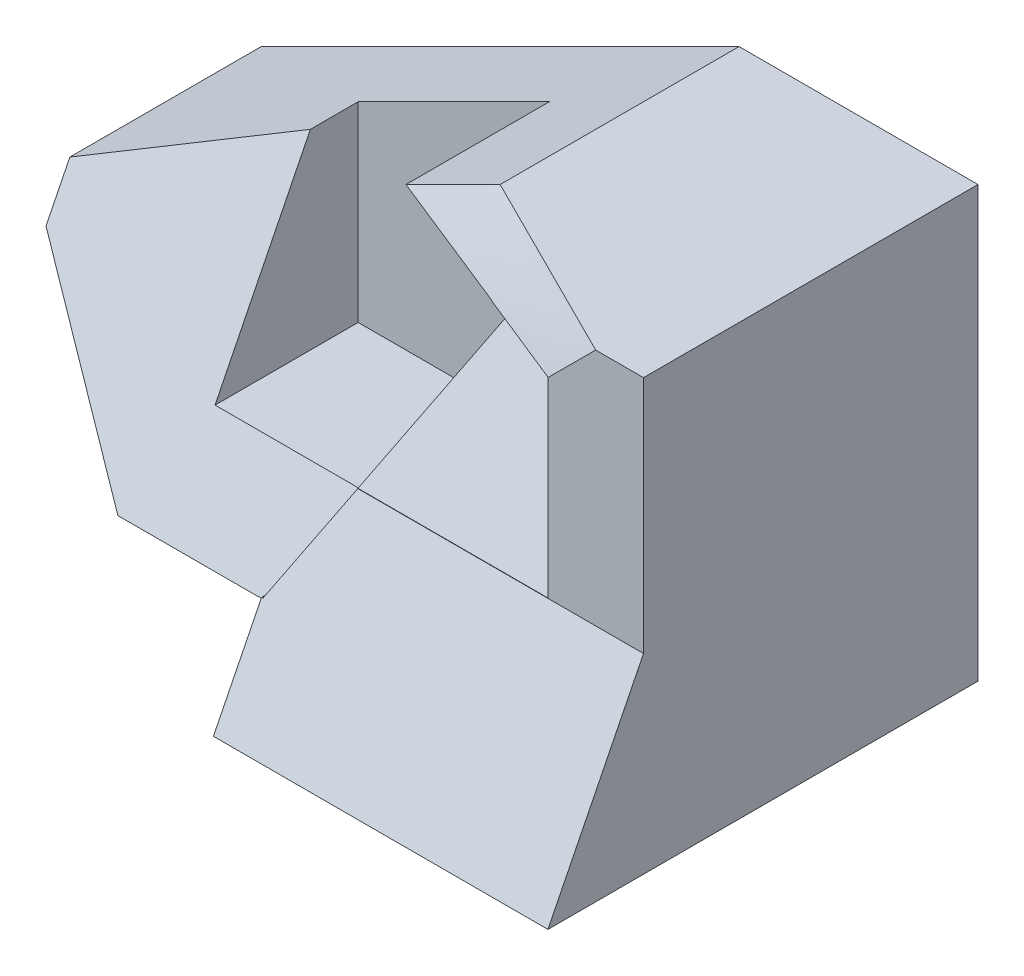
ISO-10303-21;
HEADER;
FILE_DESCRIPTION(('STEP AP214'),'2;1');
FILE_NAME('part.step','',(''),(''),'','','');
FILE_SCHEMA(('AUTOMOTIVE_DESIGN { 1 0 10303 214 1 1 1 1 }'));
ENDSEC;
DATA;
#1=APPLICATION_CONTEXT('core data for automotive mechanical design processes');
#2=APPLICATION_PROTOCOL_DEFINITION('international standard','automotive_design',2000,#1);
#3=PRODUCT_CONTEXT('',#1,'mechanical');
#4=PRODUCT('Part','Part','',(#3));
#5=PRODUCT_RELATED_PRODUCT_CATEGORY('part','',(#4));
#6=PRODUCT_DEFINITION_FORMATION('','',#4);
#7=PRODUCT_DEFINITION_CONTEXT('part definition',#1,'design');
#8=PRODUCT_DEFINITION('design','',#6,#7);
#9=PRODUCT_DEFINITION_SHAPE('','',#8);
#10=(LENGTH_UNIT() NAMED_UNIT(*) SI_UNIT(.MILLI.,.METRE.));
#11=(NAMED_UNIT(*) PLANE_ANGLE_UNIT() SI_UNIT($,.RADIAN.));
#12=(NAMED_UNIT(*) SI_UNIT($,.STERADIAN.) SOLID_ANGLE_UNIT());
#13=UNCERTAINTY_MEASURE_WITH_UNIT(LENGTH_MEASURE(1.E-05),#10,'distance_accuracy_value','');
#14=(GEOMETRIC_REPRESENTATION_CONTEXT(3) GLOBAL_UNCERTAINTY_ASSIGNED_CONTEXT((#13)) GLOBAL_UNIT_ASSIGNED_CONTEXT((#10,
#11,#12)) REPRESENTATION_CONTEXT('',''));
#15=CARTESIAN_POINT('',(0.,0.,0.));
#16=DIRECTION('',(0.,0.,1.));
#17=DIRECTION('',(1.,0.,0.));
#18=AXIS2_PLACEMENT_3D('',#15,#16,#17);
#19=CARTESIAN_POINT('',(7.5,-0.5,7.));
#20=DIRECTION('',(0.,0.,-1.));
#21=DIRECTION('',(-1.,0.,0.));
#22=AXIS2_PLACEMENT_3D('',#19,#20,#21);
#23=PLANE('',#22);
#24=DIRECTION('',(-1.,0.,0.));
#25=VECTOR('',#24,1.);
#26=CARTESIAN_POINT('',(1.5,-0.492869743501298,7.));
#27=LINE('',#26,#25);
#28=CARTESIAN_POINT('',(1.5,-0.492869743501298,7.));
#29=VERTEX_POINT('',#28);
#30=CARTESIAN_POINT('',(-2.47486662032889,-0.492869743501298,7.));
#31=VERTEX_POINT('',#30);
#32=EDGE_CURVE('E476',#29,#31,#27,.T.);
#33=ORIENTED_EDGE('',*,*,#32,.T.);
#34=DIRECTION('',(0.447213595499958,0.894427190999916,0.));
#35=VECTOR('',#34,1.);
#36=CARTESIAN_POINT('',(-0.482745398862595,3.4913726994313,7.));
#37=LINE('',#36,#35);
#38=CARTESIAN_POINT('',(-2.47843174857824,-0.5,7.));
#39=VERTEX_POINT('',#38);
#40=EDGE_CURVE('E226',#39,#31,#37,.T.);
#41=ORIENTED_EDGE('',*,*,#40,.F.);
#42=DIRECTION('',(-1.,0.,0.));
#43=VECTOR('',#42,1.);
#44=CARTESIAN_POINT('',(7.5,-0.5,7.));
#45=LINE('',#44,#43);
#46=CARTESIAN_POINT('',(3.5,-0.5,7.));
#47=VERTEX_POINT('',#46);
#48=EDGE_CURVE('E348',#47,#39,#45,.T.);
#49=ORIENTED_EDGE('',*,*,#48,.F.);
#50=DIRECTION('',(0.,-1.,0.));
#51=VECTOR('',#50,1.);
#52=CARTESIAN_POINT('',(3.5,0.,7.));
#53=LINE('',#52,#51);
#54=CARTESIAN_POINT('',(3.5,4.5,7.));
#55=VERTEX_POINT('',#54);
#56=EDGE_CURVE('E332',#55,#47,#53,.T.);
#57=ORIENTED_EDGE('',*,*,#56,.F.);
#58=DIRECTION('',(-1.,0.,0.));
#59=VECTOR('',#58,1.);
#60=CARTESIAN_POINT('',(7.5,4.5,7.));
#61=LINE('',#60,#59);
#62=CARTESIAN_POINT('',(2.49977305080841,4.5,7.));
#63=VERTEX_POINT('',#62);
#64=EDGE_CURVE('E202',#55,#63,#61,.T.);
#65=ORIENTED_EDGE('',*,*,#64,.T.);
#66=CARTESIAN_POINT('',(1.49984256727102,3.50023558025882,7.00035393969887));
#67=CARTESIAN_POINT('',(1.54154025122701,3.5418578548861,7.00028602755366));
#68=CARTESIAN_POINT('',(1.58323385365635,3.58348423070897,7.00022548460574));
#69=CARTESIAN_POINT('',(1.66661437244845,3.66674698740989,7.000119430403));
#70=CARTESIAN_POINT('',(1.70830128848242,3.70838336861796,7.00007391974148));
#71=CARTESIAN_POINT('',(1.79166827536595,3.79166630698385,6.99999822731414));
#72=CARTESIAN_POINT('',(1.83334834587801,3.83331286448009,6.99996804615703));
#73=CARTESIAN_POINT('',(1.91670218997631,3.91661540066699,6.99992183927005));
#74=CARTESIAN_POINT('',(1.95837596326924,3.95827137965143,6.99990581406888));
#75=CARTESIAN_POINT('',(2.04171776780298,4.04159198568228,6.99988672311779));
#76=CARTESIAN_POINT('',(2.08338579879336,4.08325661297931,6.99988365781909));
#77=CARTESIAN_POINT('',(2.16671612864367,4.16659454703394,6.99989050601463));
#78=CARTESIAN_POINT('',(2.20837842724855,4.20826785404655,6.99990041996821));
#79=CARTESIAN_POINT('',(2.29169636476838,4.29162470726169,6.99993546667126));
#80=CARTESIAN_POINT('',(2.33335200331941,4.33330825382781,6.99996060007591));
#81=CARTESIAN_POINT('',(2.41665290525704,4.41669087261401,7.00003419264835));
#82=CARTESIAN_POINT('',(2.45829816783691,4.45838994563868,7.00008265326727));
#83=CARTESIAN_POINT('',(2.49993468972115,4.50009772894676,7.00014682989165));
#84=B_SPLINE_CURVE_WITH_KNOTS('',3,(#66,#67,#68,#69,#70,#71,#72,#73,#74,#75,#76,#77,#78,#79,#80,
#81,#82,#83),.UNSPECIFIED.,.F.,.F.,(4,2,2,2,2,2,2,2,4),(0.,0.176748512518118,0.353504000122477,
0.530266505682153,0.707035612557251,0.883810873872694,1.06059239155166,1.23738151991769,
1.41418164734069),.UNSPECIFIED.);
#85=CARTESIAN_POINT('',(1.5,3.50063107740926,7.));
#86=VERTEX_POINT('',#85);
#87=EDGE_CURVE('E360',#63,#86,#84,.F.);
#88=ORIENTED_EDGE('',*,*,#87,.T.);
#89=DIRECTION('',(0.,-1.,0.));
#90=VECTOR('',#89,1.);
#91=CARTESIAN_POINT('',(1.5,0.,7.));
#92=LINE('',#91,#90);
#93=EDGE_CURVE('E424',#86,#29,#92,.T.);
#94=ORIENTED_EDGE('',*,*,#93,.T.);
#95=EDGE_LOOP('',(#33,#41,#49,#57,#65,#88,#94));
#96=FACE_BOUND('',#95,.T.);
#97=ADVANCED_FACE('F36',(#96),#23,.F.);
#98=CARTESIAN_POINT('',(-3.47124233143765,-2.48562116571883,21.));
#99=DIRECTION('',(-0.894427190999916,0.447213595499958,0.));
#100=DIRECTION('',(-0.447213595499958,-0.894427190999916,0.));
#101=AXIS2_PLACEMENT_3D('',#98,#99,#100);
#102=PLANE('',#101);
#103=DIRECTION('',(0.,0.,-1.));
#104=VECTOR('',#103,1.);
#105=CARTESIAN_POINT('',(-0.471242331437655,3.51437883428117,21.));
#106=LINE('',#105,#104);
#107=CARTESIAN_POINT('',(-0.471242331437655,3.51437883428117,6.20218765704122));
#108=VERTEX_POINT('',#107);
#109=CARTESIAN_POINT('',(-0.471242331437655,3.51437883428117,4.99994094462811));
#110=VERTEX_POINT('',#109);
#111=EDGE_CURVE('E183',#108,#110,#106,.T.);
#112=ORIENTED_EDGE('',*,*,#111,.T.);
#113=DIRECTION('',(-0.00216607987061889,-0.00433215974123779,0.999988270176191));
#114=VECTOR('',#113,1.);
#115=CARTESIAN_POINT('',(-0.505969709291035,3.44492407857441,21.0321154633974));
#116=LINE('',#115,#114);
#117=CARTESIAN_POINT('',(-0.473850748912953,3.50916199933143,6.20413794307477));
#118=VERTEX_POINT('',#117);
#119=EDGE_CURVE('E405',#110,#118,#116,.T.);
#120=ORIENTED_EDGE('',*,*,#119,.T.);
#121=CARTESIAN_POINT('',(-0.471242331437655,3.51437883428117,6.20218765704122));
#122=CARTESIAN_POINT('',(-0.473999030136539,3.50886543688341,6.20424452136744));
#123=CARTESIAN_POINT('',(-0.476755728835423,3.50335203948564,6.20630138569367));
#124=CARTESIAN_POINT('',(-0.479512427534307,3.49783864208787,6.2083582500199));
#125=B_SPLINE_CURVE_WITH_KNOTS('',3,(#121,#122,#123,#124),.UNSPECIFIED.,.F.,.F.,(4,4),(0.,
0.0194948368792279),.UNSPECIFIED.);
#126=EDGE_CURVE('E184',#108,#118,#125,.T.);
#127=ORIENTED_EDGE('',*,*,#126,.F.);
#128=EDGE_LOOP('',(#112,#120,#127));
#129=FACE_BOUND('',#128,.T.);
#130=ADVANCED_FACE('F453',(#129),#102,.T.);
#131=ORIENTED_EDGE('',*,*,#40,.T.);
#132=DIRECTION('',(0.408369308842792,0.816738617685584,-0.40764265966199));
#133=VECTOR('',#132,1.);
#134=CARTESIAN_POINT('',(-5.63623456727883,-6.81560563740118,10.155742633345));
#135=LINE('',#134,#133);
#136=EDGE_CURVE('E407',#31,#110,#135,.T.);
#137=ORIENTED_EDGE('',*,*,#136,.T.);
#138=CARTESIAN_POINT('',(-0.471242331437655,3.51437883428117,2.));
#139=VERTEX_POINT('',#138);
#140=EDGE_CURVE('E361',#110,#139,#106,.T.);
#141=ORIENTED_EDGE('',*,*,#140,.T.);
#142=DIRECTION('',(0.447213595499958,0.894427190999916,0.));
#143=VECTOR('',#142,1.);
#144=CARTESIAN_POINT('',(-3.47124233143765,-2.48562116571883,2.));
#145=LINE('',#144,#143);
#146=CARTESIAN_POINT('',(-3.47124233143765,-2.48562116571883,2.));
#147=VERTEX_POINT('',#146);
#148=EDGE_CURVE('E216',#147,#139,#145,.T.);
#149=ORIENTED_EDGE('',*,*,#148,.F.);
#150=DIRECTION('',(0.,0.,-1.));
#151=VECTOR('',#150,1.);
#152=CARTESIAN_POINT('',(-3.47124233143765,-2.48562116571883,21.));
#153=LINE('',#152,#151);
#154=CARTESIAN_POINT('',(-3.47124233143765,-2.48562116571883,7.99281058285941));
#155=VERTEX_POINT('',#154);
#156=EDGE_CURVE('E194',#155,#147,#153,.T.);
#157=ORIENTED_EDGE('',*,*,#156,.F.);
#158=DIRECTION('',(0.408248290463863,0.816496580927726,-0.408248290463863));
#159=VECTOR('',#158,1.);
#160=CARTESIAN_POINT('',(-2.48202645714853,-0.507189417140588,7.00359470857029));
#161=LINE('',#160,#159);
#162=EDGE_CURVE('E359',#155,#39,#161,.T.);
#163=ORIENTED_EDGE('',*,*,#162,.T.);
#164=EDGE_LOOP('',(#131,#137,#141,#149,#157,#163));
#165=FACE_BOUND('',#164,.T.);
#166=ADVANCED_FACE('F239',(#165),#102,.T.);
#167=CARTESIAN_POINT('',(-3.2134896634337,4.46783317184116,4.21721920120658));
#168=CARTESIAN_POINT('',(-3.28407811873943,4.28538441356447,4.38574103230916));
#169=CARTESIAN_POINT('',(-3.3512269981157,4.09778874520229,4.5465300444748));
#170=CARTESIAN_POINT('',(-3.414958153101,3.90507886494363,4.69963536410574));
#171=CARTESIAN_POINT('',(-3.47534520366187,3.70736493617954,4.84522250284732));
#172=CARTESIAN_POINT('',(-3.53235622426733,3.50459918620763,4.98321968605188));
#173=CARTESIAN_POINT('',(-2.04076601172285,4.48999384287458,4.73572870121885));
#174=CARTESIAN_POINT('',(-2.10791871251505,4.30240389279996,4.89652630465217));
#175=CARTESIAN_POINT('',(-2.17164424334459,4.10968559667126,5.04961898011446));
#176=CARTESIAN_POINT('',(-2.2318359484023,3.91167935694764,5.19476694512154));
#177=CARTESIAN_POINT('',(-2.28857414539643,3.70850535938198,5.33215076911223));
#178=CARTESIAN_POINT('',(-2.34190688161649,3.50023550094183,5.46187847150458));
#179=CARTESIAN_POINT('',(-0.872937499707002,4.51947949942457,5.26524340353192));
#180=CARTESIAN_POINT('',(-0.936119373834301,4.32594768668183,5.41711383563382));
#181=CARTESIAN_POINT('',(-0.995481770533379,4.12670048712986,5.56039735818878));
#182=CARTESIAN_POINT('',(-1.05099566619408,3.92169447044035,5.6950287206174));
#183=CARTESIAN_POINT('',(-1.10285577935102,3.71122100939011,5.82144568711002));
#184=CARTESIAN_POINT('',(-1.15106390058195,3.49528278336256,5.93965228322496));
#185=CARTESIAN_POINT('',(0.275747592240914,4.57761097273765,5.83779614432843));
#186=CARTESIAN_POINT('',(0.222569284786626,4.36911003029518,5.96717666157095));
#187=CARTESIAN_POINT('',(0.172096700262446,4.15656030017565,6.09047420057978));
#188=CARTESIAN_POINT('',(0.124186617438458,3.94017609565715,6.20801074983884));
#189=CARTESIAN_POINT('',(0.0791213709245529,3.71953493708494,6.31915156760593));
#190=CARTESIAN_POINT('',(0.0369493628644726,3.49456439649498,6.42378783668339));
#191=CARTESIAN_POINT('',(1.43658823136229,4.61755313736136,6.38302091002006));
#192=CARTESIAN_POINT('',(1.38919142698376,4.40040087362226,6.49940351200063));
#193=CARTESIAN_POINT('',(1.34511235000851,4.17828403140514,6.60832723363726));
#194=CARTESIAN_POINT('',(1.30441898759509,3.951100876136,6.70963922690514));
#195=CARTESIAN_POINT('',(1.26696156433691,3.71907552862697,6.80367621532022));
#196=CARTESIAN_POINT('',(1.2327330974965,3.48221843770158,6.89045389740047));
#197=CARTESIAN_POINT('',(2.5858601268592,4.67480653001384,6.95425440516278));
#198=CARTESIAN_POINT('',(2.54583571980497,4.44662236381905,7.05406245992905));
#199=CARTESIAN_POINT('',(2.50903737272003,4.21361078839335,7.14661772012595));
#200=CARTESIAN_POINT('',(2.47546454410003,3.97577261403259,7.23192140315789));
#201=CARTESIAN_POINT('',(2.44508778172904,3.73315191242188,7.31003972319135));
#202=CARTESIAN_POINT('',(2.41790503482301,3.48575175231194,7.38097729077776));
#203=B_SPLINE_SURFACE_WITH_KNOTS('',5,5,((#167,#168,#169,#170,#171,#172),(#173,#174,#175,#176,
#177,#178),(#179,#180,#181,#182,#183,#184),(#185,#186,#187,#188,#189,#190),(#191,#192,#193,#194,
#195,#196),(#197,#198,#199,#200,#201,#202)),.UNSPECIFIED.,.F.,.F.,.F.,(6,6),(6,6),
(-3.4285849144312,2.98339906144865),(-0.670377309816486,0.583775874128713),.UNSPECIFIED.);
#204=CARTESIAN_POINT('',(1.5,3.50572202585628,6.99818371477744));
#205=CARTESIAN_POINT('',(1.30012710367205,3.50607300829005,6.91716677685818));
#206=CARTESIAN_POINT('',(1.10012625514357,3.50642261544335,6.83646729360875));
#207=CARTESIAN_POINT('',(0.699989385653941,3.50712037444913,6.67540425280094));
#208=CARTESIAN_POINT('',(0.499853364776682,3.50746852630251,6.59504069503433));
#209=CARTESIAN_POINT('',(0.099566654336689,3.50816467036592,6.43435042982094));
#210=CARTESIAN_POINT('',(-0.100584035224583,3.50851266257597,6.35402372237049));
#211=CARTESIAN_POINT('',(-0.500858306521412,3.50920893998122,6.19330267798909));
#212=CARTESIAN_POINT('',(-0.700981888255226,3.50955722517644,6.11290834105379));
#213=CARTESIAN_POINT('',(-1.11524491337625,3.51027857106293,5.94640076323622));
#214=CARTESIAN_POINT('',(-1.32938220864821,3.5106516548969,5.86028218034809));
#215=CARTESIAN_POINT('',(-1.75765419143256,3.51139785069613,5.68803852105331));
#216=CARTESIAN_POINT('',(-1.97178887894494,3.51177096266139,5.60191344464666));
#217=CARTESIAN_POINT('',(-2.40009756015266,3.51251676283329,5.42976110762689));
#218=CARTESIAN_POINT('',(-2.61427155384545,3.51288945103996,5.34373384700746));
#219=CARTESIAN_POINT('',(-3.04265623516407,3.51363443211283,5.17177058182976));
#220=CARTESIAN_POINT('',(-3.25686692279881,3.51400672497893,5.08583457729369));
#221=CARTESIAN_POINT('',(-3.47109459230427,3.51437883428118,4.9999409446281));
#222=B_SPLINE_CURVE_WITH_KNOTS('',3,(#204,#205,#206,#207,#208,#209,#210,#211,#212,#213,#214,
#215,#216,#217,#218,#219,#220,#221),.UNSPECIFIED.,.F.,.F.,(4,2,2,2,2,2,2,2,4),(0.,
0.647005310609708,1.29401022008973,1.94101506520057,2.58801995187272,3.28043743970547,
3.97285492909964,4.66527237382895,5.35768998689814),.UNSPECIFIED.);
#223=CARTESIAN_POINT('',(1.5,3.50572202585627,6.99818371477744));
#224=VERTEX_POINT('',#223);
#225=EDGE_CURVE('E11',#224,#118,#222,.T.);
#226=CARTESIAN_POINT('',(1.5,3.50126215481852,7.));
#227=CARTESIAN_POINT('',(1.5,3.50746234393385,6.99747730917893));
#228=CARTESIAN_POINT('',(1.5,3.51365911940229,6.99494629259966));
#229=CARTESIAN_POINT('',(1.5,3.52604584304541,6.98986760792473));
#230=CARTESIAN_POINT('',(1.5,3.53223579122008,6.98731993982906));
#231=CARTESIAN_POINT('',(1.5,3.53842232574787,6.9847639459752));
#232=B_SPLINE_CURVE_WITH_KNOTS('',3,(#226,#227,#228,#229,#230,#231),.UNSPECIFIED.,.F.,.F.,(4,2,
4),(0.,0.0200812011637112,0.0401624023274225),.UNSPECIFIED.);
#233=EDGE_CURVE('E51',#86,#224,#232,.T.);
#234=CARTESIAN_POINT('',(2.49993468972115,4.50009772894675,7.00014682989165));
#235=CARTESIAN_POINT('',(2.33345557695822,4.49983290081084,6.91642090086645));
#236=CARTESIAN_POINT('',(2.16683474999721,4.49976088713092,6.83297822997393));
#237=CARTESIAN_POINT('',(1.83347267209199,4.49979705916684,6.66636362311954));
#238=CARTESIAN_POINT('',(1.66673143068722,4.49990523190226,6.5831916680881));
#239=CARTESIAN_POINT('',(1.33326730061088,4.50009636840307,6.41681063661702));
#240=CARTESIAN_POINT('',(1.16654441196149,4.50017933213833,6.33360156013311));
#241=CARTESIAN_POINT('',(0.833164751680959,4.50024754669951,6.16703701009704));
#242=CARTESIAN_POINT('',(0.666507982441921,4.5002327942645,6.08368153175203));
#243=CARTESIAN_POINT('',(0.333255967633228,4.50011247950186,5.91683455912062));
#244=CARTESIAN_POINT('',(0.166660724193121,4.50000691428074,5.83334306058492));
#245=CARTESIAN_POINT('',(-0.16652078419013,4.49978320649569,5.66634145372291));
#246=CARTESIAN_POINT('',(-0.333107049115534,4.49966506390777,5.58283134536139));
#247=CARTESIAN_POINT('',(-0.666355163601437,4.49954185336757,5.41598100462343));
#248=CARTESIAN_POINT('',(-0.833017009267356,4.49953678013314,5.33264076449329));
#249=CARTESIAN_POINT('',(-1.16651255958516,4.49978379684434,5.16634665023584));
#250=CARTESIAN_POINT('',(-1.33334624572982,4.50003586150704,5.08339273892854));
#251=CARTESIAN_POINT('',(-1.50032647095271,4.50048852436276,5.00073396861044));
#252=B_SPLINE_CURVE_WITH_KNOTS('',3,(#234,#235,#236,#237,#238,#239,#240,#241,#242,#243,#244,
#245,#246,#247,#248,#249,#250,#251),.UNSPECIFIED.,.F.,.F.,(4,2,2,2,2,2,2,2,4),(0.,
0.559040974090787,1.11804167730023,1.67704304878991,2.23606307508216,2.79510091359075,
3.35413981887926,3.91315260803503,4.47211043790707),.UNSPECIFIED.);
#253=CARTESIAN_POINT('',(-1.5,4.5,5.00068296115107));
#254=VERTEX_POINT('',#253);
#255=EDGE_CURVE('E165',#254,#63,#252,.F.);
#256=CARTESIAN_POINT('',(-1.50032647095271,4.50048852436276,5.00073396861044));
#257=CARTESIAN_POINT('',(-1.58227400370993,4.45911892818304,5.00028821139796));
#258=CARTESIAN_POINT('',(-1.66427133232338,4.4178471622897,4.99998066254329));
#259=CARTESIAN_POINT('',(-1.82835653484372,4.3354391143639,4.99956912079851));
#260=CARTESIAN_POINT('',(-1.9104444243498,4.29430286315335,4.99946517140138));
#261=CARTESIAN_POINT('',(-2.07467843724709,4.2121174093226,4.99938809050913));
#262=CARTESIAN_POINT('',(-2.15682456729699,4.17106822001959,4.99941497776024));
#263=CARTESIAN_POINT('',(-2.32114716658342,4.08901500769401,4.99953669851315));
#264=CARTESIAN_POINT('',(-2.40332363765996,4.04801098836634,4.99963153721195));
#265=CARTESIAN_POINT('',(-2.56768303328196,3.96601236079253,4.99983544647791));
#266=CARTESIAN_POINT('',(-2.64986595791472,3.92501775272219,4.99994451729222));
#267=CARTESIAN_POINT('',(-2.8142181522083,3.84300790375152,5.00013173493819));
#268=CARTESIAN_POINT('',(-2.89638742223132,3.80199266357981,5.00020988279432));
#269=CARTESIAN_POINT('',(-3.06069482985135,3.71991556912269,5.00029615515558));
#270=CARTESIAN_POINT('',(-3.14283296936002,3.67885371867448,5.00030428505828));
#271=CARTESIAN_POINT('',(-3.30706019645099,3.59665661475522,5.00021026374868));
#272=CARTESIAN_POINT('',(-3.38914928871167,3.5555213706129,5.00010812567599));
#273=CARTESIAN_POINT('',(-3.47121151812906,3.51433272588524,4.99993072583914));
#274=B_SPLINE_CURVE_WITH_KNOTS('',3,(#256,#257,#258,#259,#260,#261,#262,#263,#264,#265,#266,
#267,#268,#269,#270,#271,#272,#273),.UNSPECIFIED.,.F.,.F.,(4,2,2,2,2,2,2,2,4),(0.,
0.275396135059829,0.55085109390474,0.826345521014544,1.10186102048539,1.37738130479861,
1.65289246050575,1.92838237725169,2.20383947002878),.UNSPECIFIED.);
#275=CARTESIAN_POINT('',(-3.47124233143765,3.51437883428117,4.99994094462811));
#276=VERTEX_POINT('',#275);
#277=EDGE_CURVE('E156',#276,#254,#274,.F.);
#278=CARTESIAN_POINT('',(-3.47124233143765,3.51437883428117,4.99988188925621));
#279=CARTESIAN_POINT('',(-3.27097179221291,3.51437883428117,5.07990803002236));
#280=CARTESIAN_POINT('',(-3.07071855110215,3.51437883428117,5.15997750968696));
#281=CARTESIAN_POINT('',(-2.67025308124193,3.51437883428117,5.32021879278759));
#282=CARTESIAN_POINT('',(-2.4700408524806,3.51437883428117,5.40039059619399));
#283=CARTESIAN_POINT('',(-1.86947512275414,3.51437883428117,5.64108303541244));
#284=CARTESIAN_POINT('',(-1.46919259065512,3.51437883428116,5.80178069530758));
#285=CARTESIAN_POINT('',(-0.969282948578844,3.51437883428117,6.00239040933996));
#286=CARTESIAN_POINT('',(-0.869677697932262,3.51437883428117,6.0423570152175));
#287=CARTESIAN_POINT('',(-0.67046324449588,3.51437883428117,6.12228038169082));
#288=CARTESIAN_POINT('',(-0.570854041706001,3.51437883428118,6.16223714228641));
#289=CARTESIAN_POINT('',(-0.471242331437654,3.51437883428118,6.20218765704122));
#290=B_SPLINE_CURVE_WITH_KNOTS('',3,(#278,#279,#280,#281,#282,#283,#284,#285,#286,#287,#288,
#289),.UNSPECIFIED.,.F.,.F.,(4,2,2,2,2,4),(0.,0.64700253750303,1.29400488776821,
2.58800962806077,2.90998295127158,3.23195628099641),.UNSPECIFIED.);
#291=EDGE_CURVE('E162',#276,#108,#290,.T.);
#292=ORIENTED_EDGE('',*,*,#225,.F.);
#293=ORIENTED_EDGE('',*,*,#233,.F.);
#294=ORIENTED_EDGE('',*,*,#87,.F.);
#295=ORIENTED_EDGE('',*,*,#255,.F.);
#296=ORIENTED_EDGE('',*,*,#277,.F.);
#297=ORIENTED_EDGE('',*,*,#291,.T.);
#298=ORIENTED_EDGE('',*,*,#126,.T.);
#299=EDGE_LOOP('',(#292,#293,#294,#295,#296,#297,#298));
#300=FACE_BOUND('',#299,.T.);
#301=ADVANCED_FACE('F160',(#300),#203,.F.);
#302=CARTESIAN_POINT('',(-2.1,4.2,9.));
#303=DIRECTION('',(0.447213595499958,-0.894427190999916,0.));
#304=DIRECTION('',(0.894427190999916,0.447213595499958,0.));
#305=AXIS2_PLACEMENT_3D('',#302,#303,#304);
#306=PLANE('',#305);
#307=DIRECTION('',(0.,0.,-1.));
#308=VECTOR('',#307,1.);
#309=CARTESIAN_POINT('',(-11.5,-0.5,9.));
#310=LINE('',#309,#308);
#311=CARTESIAN_POINT('',(-11.5,-0.5,4.00478148606111));
#312=VERTEX_POINT('',#311);
#313=CARTESIAN_POINT('',(-11.5,-0.5,0.));
#314=VERTEX_POINT('',#313);
#315=EDGE_CURVE('E342',#312,#314,#310,.T.);
#316=ORIENTED_EDGE('',*,*,#315,.F.);
#317=DIRECTION('',(0.872970831070683,0.436485415535342,-0.217720945535106));
#318=VECTOR('',#317,1.);
#319=CARTESIAN_POINT('',(-3.49499404046562,3.50250297976719,2.00831447422934));
#320=LINE('',#319,#318);
#321=CARTESIAN_POINT('',(-7.47124233143766,1.51437883428117,3.));
#322=VERTEX_POINT('',#321);
#323=EDGE_CURVE('E401',#312,#322,#320,.T.);
#324=ORIENTED_EDGE('',*,*,#323,.T.);
#325=DIRECTION('',(0.,0.,-1.));
#326=VECTOR('',#325,1.);
#327=CARTESIAN_POINT('',(-7.47124233143766,1.51437883428117,21.));
#328=LINE('',#327,#326);
#329=CARTESIAN_POINT('',(-7.47124233143766,1.51437883428117,2.));
#330=VERTEX_POINT('',#329);
#331=EDGE_CURVE('E172',#322,#330,#328,.T.);
#332=ORIENTED_EDGE('',*,*,#331,.T.);
#333=DIRECTION('',(-0.894427190999916,-0.447213595499958,0.));
#334=VECTOR('',#333,1.);
#335=CARTESIAN_POINT('',(-3.47124233143765,3.51437883428117,2.));
#336=LINE('',#335,#334);
#337=CARTESIAN_POINT('',(-3.47124233143765,3.51437883428117,2.));
#338=VERTEX_POINT('',#337);
#339=EDGE_CURVE('E190',#338,#330,#336,.T.);
#340=ORIENTED_EDGE('',*,*,#339,.F.);
#341=DIRECTION('',(0.,0.,-1.));
#342=VECTOR('',#341,1.);
#343=CARTESIAN_POINT('',(-3.47124233143765,3.51437883428117,21.));
#344=LINE('',#343,#342);
#345=EDGE_CURVE('E179',#276,#338,#344,.T.);
#346=ORIENTED_EDGE('',*,*,#345,.F.);
#347=ORIENTED_EDGE('',*,*,#277,.T.);
#348=DIRECTION('',(0.,0.,-1.));
#349=VECTOR('',#348,1.);
#350=CARTESIAN_POINT('',(-1.5,4.5,9.));
#351=LINE('',#350,#349);
#352=CARTESIAN_POINT('',(-1.5,4.5,0.));
#353=VERTEX_POINT('',#352);
#354=EDGE_CURVE('E171',#254,#353,#351,.T.);
#355=ORIENTED_EDGE('',*,*,#354,.T.);
#356=DIRECTION('',(-0.894427190999916,-0.447213595499958,0.));
#357=VECTOR('',#356,1.);
#358=CARTESIAN_POINT('',(-2.1,4.2,0.));
#359=LINE('',#358,#357);
#360=EDGE_CURVE('E321',#353,#314,#359,.T.);
#361=ORIENTED_EDGE('',*,*,#360,.T.);
#362=EDGE_LOOP('',(#316,#324,#332,#340,#346,#347,#355,#361));
#363=FACE_BOUND('',#362,.T.);
#364=ADVANCED_FACE('F38',(#363),#306,.F.);
#365=CARTESIAN_POINT('',(-7.47124233143766,1.51437883428117,21.));
#366=DIRECTION('',(1.,0.,0.));
#367=DIRECTION('',(0.,1.,0.));
#368=AXIS2_PLACEMENT_3D('',#365,#366,#367);
#369=PLANE('',#368);
#370=DIRECTION('',(0.,0.894854655136054,-0.446357643802964));
#371=VECTOR('',#370,1.);
#372=CARTESIAN_POINT('',(-7.47124233143765,-5.6752750431464,6.58623263126401));
#373=LINE('',#372,#371);
#374=CARTESIAN_POINT('',(-7.47124233143765,-2.48562116571883,4.99521851393889));
#375=VERTEX_POINT('',#374);
#376=EDGE_CURVE('E396',#375,#322,#373,.T.);
#377=ORIENTED_EDGE('',*,*,#376,.F.);
#378=DIRECTION('',(0.,0.,-1.));
#379=VECTOR('',#378,1.);
#380=CARTESIAN_POINT('',(-7.47124233143765,-2.48562116571883,21.));
#381=LINE('',#380,#379);
#382=CARTESIAN_POINT('',(-7.47124233143765,-2.48562116571883,2.));
#383=VERTEX_POINT('',#382);
#384=EDGE_CURVE('E345',#375,#383,#381,.T.);
#385=ORIENTED_EDGE('',*,*,#384,.T.);
#386=DIRECTION('',(0.,-1.,0.));
#387=VECTOR('',#386,1.);
#388=CARTESIAN_POINT('',(-7.47124233143766,1.51437883428117,2.));
#389=LINE('',#388,#387);
#390=EDGE_CURVE('E222',#330,#383,#389,.T.);
#391=ORIENTED_EDGE('',*,*,#390,.F.);
#392=ORIENTED_EDGE('',*,*,#331,.F.);
#393=EDGE_LOOP('',(#377,#385,#391,#392));
#394=FACE_BOUND('',#393,.T.);
#395=ADVANCED_FACE('F454',(#394),#369,.T.);
#396=CARTESIAN_POINT('',(7.5,-4.5,9.));
#397=DIRECTION('',(0.,-0.447213595499958,-0.894427190999916));
#398=DIRECTION('',(0.,0.894427190999916,-0.447213595499958));
#399=AXIS2_PLACEMENT_3D('',#396,#397,#398);
#400=PLANE('',#399);
#401=DIRECTION('',(1.,0.,0.));
#402=VECTOR('',#401,1.);
#403=CARTESIAN_POINT('',(7.5,-2.48562116571883,7.99281058285941));
#404=LINE('',#403,#402);
#405=CARTESIAN_POINT('',(-3.5,-2.48562116571883,7.99281058285941));
#406=VERTEX_POINT('',#405);
#407=EDGE_CURVE('E191',#406,#155,#404,.T.);
#408=ORIENTED_EDGE('',*,*,#407,.F.);
#409=DIRECTION('',(0.,-0.894427190999916,0.447213595499958));
#410=VECTOR('',#409,1.);
#411=CARTESIAN_POINT('',(-3.5,-4.5,9.));
#412=LINE('',#411,#410);
#413=CARTESIAN_POINT('',(-3.5,-4.5,9.));
#414=VERTEX_POINT('',#413);
#415=EDGE_CURVE('E87',#406,#414,#412,.T.);
#416=ORIENTED_EDGE('',*,*,#415,.T.);
#417=DIRECTION('',(1.,0.,0.));
#418=VECTOR('',#417,1.);
#419=CARTESIAN_POINT('',(0.,-4.5,9.));
#420=LINE('',#419,#418);
#421=CARTESIAN_POINT('',(3.5,-4.5,9.));
#422=VERTEX_POINT('',#421);
#423=EDGE_CURVE('E346',#414,#422,#420,.T.);
#424=ORIENTED_EDGE('',*,*,#423,.T.);
#425=DIRECTION('',(0.,-0.894427190999916,0.447213595499958));
#426=VECTOR('',#425,1.);
#427=CARTESIAN_POINT('',(3.5,-0.9,7.2));
#428=LINE('',#427,#426);
#429=EDGE_CURVE('E351',#47,#422,#428,.T.);
#430=ORIENTED_EDGE('',*,*,#429,.F.);
#431=ORIENTED_EDGE('',*,*,#48,.T.);
#432=ORIENTED_EDGE('',*,*,#162,.F.);
#433=EDGE_LOOP('',(#408,#416,#424,#430,#431,#432));
#434=FACE_BOUND('',#433,.T.);
#435=ADVANCED_FACE('F286',(#434),#400,.F.);
#436=CARTESIAN_POINT('',(-11.5,0.,9.));
#437=DIRECTION('',(1.,0.,0.));
#438=DIRECTION('',(0.,0.,-1.));
#439=AXIS2_PLACEMENT_3D('',#436,#437,#438);
#440=PLANE('',#439);
#441=DIRECTION('',(0.,0.,-1.));
#442=VECTOR('',#441,1.);
#443=CARTESIAN_POINT('',(-11.5,-1.5,9.));
#444=LINE('',#443,#442);
#445=CARTESIAN_POINT('',(-11.5,-1.5,4.50358611454583));
#446=VERTEX_POINT('',#445);
#447=CARTESIAN_POINT('',(-11.5,-1.5,0.));
#448=VERTEX_POINT('',#447);
#449=EDGE_CURVE('E338',#446,#448,#444,.T.);
#450=ORIENTED_EDGE('',*,*,#449,.F.);
#451=DIRECTION('',(0.,-0.894854655136054,0.446357643802964));
#452=VECTOR('',#451,1.);
#453=CARTESIAN_POINT('',(-11.5,-4.5,6.));
#454=LINE('',#453,#452);
#455=EDGE_CURVE('E412',#312,#446,#454,.T.);
#456=ORIENTED_EDGE('',*,*,#455,.F.);
#457=ORIENTED_EDGE('',*,*,#315,.T.);
#458=DIRECTION('',(0.,-1.,0.));
#459=VECTOR('',#458,1.);
#460=CARTESIAN_POINT('',(-11.5,0.,0.));
#461=LINE('',#460,#459);
#462=EDGE_CURVE('E339',#314,#448,#461,.T.);
#463=ORIENTED_EDGE('',*,*,#462,.T.);
#464=EDGE_LOOP('',(#450,#456,#457,#463));
#465=FACE_BOUND('',#464,.T.);
#466=ADVANCED_FACE('F282',(#465),#440,.F.);
#467=CARTESIAN_POINT('',(-6.5,-6.5,9.));
#468=DIRECTION('',(0.707106781186548,0.707106781186547,0.));
#469=DIRECTION('',(-0.707106781186547,0.707106781186548,0.));
#470=AXIS2_PLACEMENT_3D('',#467,#468,#469);
#471=PLANE('',#470);
#472=DIRECTION('',(0.,0.,-1.));
#473=VECTOR('',#472,1.);
#474=CARTESIAN_POINT('',(-8.5,-4.5,9.));
#475=LINE('',#474,#473);
#476=CARTESIAN_POINT('',(-8.5,-4.5,6.));
#477=VERTEX_POINT('',#476);
#478=CARTESIAN_POINT('',(-8.5,-4.5,0.));
#479=VERTEX_POINT('',#478);
#480=EDGE_CURVE('E333',#477,#479,#475,.T.);
#481=ORIENTED_EDGE('',*,*,#480,.F.);
#482=DIRECTION('',(-0.666843617478333,0.666843617478333,-0.332624682873688));
#483=VECTOR('',#482,1.);
#484=CARTESIAN_POINT('',(-6.05585241894343,-6.94414758105658,7.21915212613076));
#485=LINE('',#484,#483);
#486=EDGE_CURVE('E59',#477,#446,#485,.T.);
#487=ORIENTED_EDGE('',*,*,#486,.T.);
#488=ORIENTED_EDGE('',*,*,#449,.T.);
#489=DIRECTION('',(0.707106781186547,-0.707106781186548,0.));
#490=VECTOR('',#489,1.);
#491=CARTESIAN_POINT('',(-6.5,-6.5,0.));
#492=LINE('',#491,#490);
#493=EDGE_CURVE('E334',#448,#479,#492,.T.);
#494=ORIENTED_EDGE('',*,*,#493,.T.);
#495=EDGE_LOOP('',(#481,#487,#488,#494));
#496=FACE_BOUND('',#495,.T.);
#497=ADVANCED_FACE('F285',(#496),#471,.F.);
#498=CARTESIAN_POINT('',(0.,-4.5,9.));
#499=DIRECTION('',(0.,1.,0.));
#500=DIRECTION('',(0.,0.,1.));
#501=AXIS2_PLACEMENT_3D('',#498,#499,#500);
#502=PLANE('',#501);
#503=DIRECTION('',(0.,0.,1.));
#504=VECTOR('',#503,1.);
#505=CARTESIAN_POINT('',(-3.5,-4.5,9.));
#506=LINE('',#505,#504);
#507=CARTESIAN_POINT('',(-3.5,-4.5,6.));
#508=VERTEX_POINT('',#507);
#509=EDGE_CURVE('E84',#508,#414,#506,.T.);
#510=ORIENTED_EDGE('',*,*,#509,.F.);
#511=DIRECTION('',(-1.,0.,0.));
#512=VECTOR('',#511,1.);
#513=CARTESIAN_POINT('',(-3.5,-4.5,6.));
#514=LINE('',#513,#512);
#515=EDGE_CURVE('E337',#508,#477,#514,.T.);
#516=ORIENTED_EDGE('',*,*,#515,.T.);
#517=ORIENTED_EDGE('',*,*,#480,.T.);
#518=DIRECTION('',(1.,0.,0.));
#519=VECTOR('',#518,1.);
#520=CARTESIAN_POINT('',(0.,-4.5,0.));
#521=LINE('',#520,#519);
#522=CARTESIAN_POINT('',(3.5,-4.5,0.));
#523=VERTEX_POINT('',#522);
#524=EDGE_CURVE('E330',#479,#523,#521,.T.);
#525=ORIENTED_EDGE('',*,*,#524,.T.);
#526=DIRECTION('',(0.,0.,-1.));
#527=VECTOR('',#526,1.);
#528=CARTESIAN_POINT('',(3.5,-4.5,9.));
#529=LINE('',#528,#527);
#530=EDGE_CURVE('E329',#422,#523,#529,.T.);
#531=ORIENTED_EDGE('',*,*,#530,.F.);
#532=ORIENTED_EDGE('',*,*,#423,.F.);
#533=EDGE_LOOP('',(#510,#516,#517,#525,#531,#532));
#534=FACE_BOUND('',#533,.T.);
#535=ADVANCED_FACE('F290',(#534),#502,.F.);
#536=CARTESIAN_POINT('',(3.5,0.,9.));
#537=DIRECTION('',(-1.,0.,0.));
#538=DIRECTION('',(0.,0.,1.));
#539=AXIS2_PLACEMENT_3D('',#536,#537,#538);
#540=PLANE('',#539);
#541=ORIENTED_EDGE('',*,*,#56,.T.);
#542=ORIENTED_EDGE('',*,*,#429,.T.);
#543=ORIENTED_EDGE('',*,*,#530,.T.);
#544=DIRECTION('',(0.,1.,0.));
#545=VECTOR('',#544,1.);
#546=CARTESIAN_POINT('',(3.5,0.,0.));
#547=LINE('',#546,#545);
#548=CARTESIAN_POINT('',(3.5,4.5,0.));
#549=VERTEX_POINT('',#548);
#550=EDGE_CURVE('E326',#523,#549,#547,.T.);
#551=ORIENTED_EDGE('',*,*,#550,.T.);
#552=DIRECTION('',(0.,0.,-1.));
#553=VECTOR('',#552,1.);
#554=CARTESIAN_POINT('',(3.5,4.5,9.));
#555=LINE('',#554,#553);
#556=EDGE_CURVE('E197',#55,#549,#555,.T.);
#557=ORIENTED_EDGE('',*,*,#556,.F.);
#558=EDGE_LOOP('',(#541,#542,#543,#551,#557));
#559=FACE_BOUND('',#558,.T.);
#560=ADVANCED_FACE('F294',(#559),#540,.F.);
#561=CARTESIAN_POINT('',(0.,4.5,9.));
#562=DIRECTION('',(0.,1.,0.));
#563=DIRECTION('',(0.,0.,1.));
#564=AXIS2_PLACEMENT_3D('',#561,#562,#563);
#565=PLANE('',#564);
#566=ORIENTED_EDGE('',*,*,#255,.T.);
#567=ORIENTED_EDGE('',*,*,#64,.F.);
#568=ORIENTED_EDGE('',*,*,#556,.T.);
#569=DIRECTION('',(1.,0.,0.));
#570=VECTOR('',#569,1.);
#571=CARTESIAN_POINT('',(0.,4.5,0.));
#572=LINE('',#571,#570);
#573=EDGE_CURVE('E192',#353,#549,#572,.T.);
#574=ORIENTED_EDGE('',*,*,#573,.F.);
#575=ORIENTED_EDGE('',*,*,#354,.F.);
#576=EDGE_LOOP('',(#566,#567,#568,#574,#575));
#577=FACE_BOUND('',#576,.T.);
#578=ADVANCED_FACE('F298',(#577),#565,.T.);
#579=CARTESIAN_POINT('',(0.,0.,0.));
#580=DIRECTION('',(0.,0.,1.));
#581=DIRECTION('',(1.,0.,0.));
#582=AXIS2_PLACEMENT_3D('',#579,#580,#581);
#583=PLANE('',#582);
#584=ORIENTED_EDGE('',*,*,#360,.F.);
#585=ORIENTED_EDGE('',*,*,#573,.T.);
#586=ORIENTED_EDGE('',*,*,#550,.F.);
#587=ORIENTED_EDGE('',*,*,#524,.F.);
#588=ORIENTED_EDGE('',*,*,#493,.F.);
#589=ORIENTED_EDGE('',*,*,#462,.F.);
#590=EDGE_LOOP('',(#584,#585,#586,#587,#588,#589));
#591=FACE_BOUND('',#590,.T.);
#592=ADVANCED_FACE('F303',(#591),#583,.F.);
#593=CARTESIAN_POINT('',(-0.471242331437655,3.51437883428117,21.));
#594=DIRECTION('',(0.,-1.,0.));
#595=DIRECTION('',(1.,0.,0.));
#596=AXIS2_PLACEMENT_3D('',#593,#594,#595);
#597=PLANE('',#596);
#598=ORIENTED_EDGE('',*,*,#291,.F.);
#599=ORIENTED_EDGE('',*,*,#345,.T.);
#600=DIRECTION('',(-1.,0.,0.));
#601=VECTOR('',#600,1.);
#602=CARTESIAN_POINT('',(-0.471242331437655,3.51437883428117,2.));
#603=LINE('',#602,#601);
#604=EDGE_CURVE('E185',#139,#338,#603,.T.);
#605=ORIENTED_EDGE('',*,*,#604,.F.);
#606=ORIENTED_EDGE('',*,*,#140,.F.);
#607=ORIENTED_EDGE('',*,*,#111,.F.);
#608=EDGE_LOOP('',(#598,#599,#605,#606,#607));
#609=FACE_BOUND('',#608,.T.);
#610=ADVANCED_FACE('F177',(#609),#597,.T.);
#611=CARTESIAN_POINT('',(-7.47124233143765,-2.48562116571883,21.));
#612=DIRECTION('',(0.,1.,0.));
#613=DIRECTION('',(0.,0.,1.));
#614=AXIS2_PLACEMENT_3D('',#611,#612,#613);
#615=PLANE('',#614);
#616=DIRECTION('',(-1.,0.,0.));
#617=VECTOR('',#616,1.);
#618=CARTESIAN_POINT('',(-7.47124233143765,-2.48562116571883,4.99521851393889));
#619=LINE('',#618,#617);
#620=CARTESIAN_POINT('',(-3.5,-2.48562116571883,4.99521851393889));
#621=VERTEX_POINT('',#620);
#622=EDGE_CURVE('E394',#621,#375,#619,.T.);
#623=ORIENTED_EDGE('',*,*,#622,.F.);
#624=DIRECTION('',(0.,0.,-1.));
#625=VECTOR('',#624,1.);
#626=CARTESIAN_POINT('',(-3.5,-2.48562116571883,21.));
#627=LINE('',#626,#625);
#628=EDGE_CURVE('E398',#406,#621,#627,.T.);
#629=ORIENTED_EDGE('',*,*,#628,.F.);
#630=ORIENTED_EDGE('',*,*,#407,.T.);
#631=ORIENTED_EDGE('',*,*,#156,.T.);
#632=DIRECTION('',(1.,0.,0.));
#633=VECTOR('',#632,1.);
#634=CARTESIAN_POINT('',(-7.47124233143765,-2.48562116571883,2.));
#635=LINE('',#634,#633);
#636=EDGE_CURVE('E219',#383,#147,#635,.T.);
#637=ORIENTED_EDGE('',*,*,#636,.F.);
#638=ORIENTED_EDGE('',*,*,#384,.F.);
#639=EDGE_LOOP('',(#623,#629,#630,#631,#637,#638));
#640=FACE_BOUND('',#639,.T.);
#641=ADVANCED_FACE('F464',(#640),#615,.T.);
#642=CARTESIAN_POINT('',(0.,0.,2.));
#643=DIRECTION('',(0.,0.,1.));
#644=DIRECTION('',(1.,0.,0.));
#645=AXIS2_PLACEMENT_3D('',#642,#643,#644);
#646=PLANE('',#645);
#647=ORIENTED_EDGE('',*,*,#339,.T.);
#648=ORIENTED_EDGE('',*,*,#390,.T.);
#649=ORIENTED_EDGE('',*,*,#636,.T.);
#650=ORIENTED_EDGE('',*,*,#148,.T.);
#651=ORIENTED_EDGE('',*,*,#604,.T.);
#652=EDGE_LOOP('',(#647,#648,#649,#650,#651));
#653=FACE_BOUND('',#652,.T.);
#654=ADVANCED_FACE('F240',(#653),#646,.T.);
#655=CARTESIAN_POINT('',(-3.5,0.,0.));
#656=DIRECTION('',(1.,0.,0.));
#657=DIRECTION('',(0.,0.,-1.));
#658=AXIS2_PLACEMENT_3D('',#655,#656,#657);
#659=PLANE('',#658);
#660=ORIENTED_EDGE('',*,*,#628,.T.);
#661=DIRECTION('',(0.,-0.894854655136054,0.446357643802964));
#662=VECTOR('',#661,1.);
#663=CARTESIAN_POINT('',(-3.5,-4.5,6.));
#664=LINE('',#663,#662);
#665=EDGE_CURVE('E80',#621,#508,#664,.T.);
#666=ORIENTED_EDGE('',*,*,#665,.T.);
#667=ORIENTED_EDGE('',*,*,#509,.T.);
#668=ORIENTED_EDGE('',*,*,#415,.F.);
#669=EDGE_LOOP('',(#660,#666,#667,#668));
#670=FACE_BOUND('',#669,.T.);
#671=ADVANCED_FACE('F457',(#670),#659,.F.);
#672=CARTESIAN_POINT('',(-3.5,-4.5,6.));
#673=DIRECTION('',(0.,-0.446357643802964,-0.894854655136054));
#674=DIRECTION('',(0.,0.894854655136054,-0.446357643802964));
#675=AXIS2_PLACEMENT_3D('',#672,#673,#674);
#676=PLANE('',#675);
#677=ORIENTED_EDGE('',*,*,#515,.F.);
#678=ORIENTED_EDGE('',*,*,#665,.F.);
#679=ORIENTED_EDGE('',*,*,#622,.T.);
#680=ORIENTED_EDGE('',*,*,#376,.T.);
#681=ORIENTED_EDGE('',*,*,#323,.F.);
#682=ORIENTED_EDGE('',*,*,#455,.T.);
#683=ORIENTED_EDGE('',*,*,#486,.F.);
#684=EDGE_LOOP('',(#677,#678,#679,#680,#681,#682,#683));
#685=FACE_BOUND('',#684,.T.);
#686=ADVANCED_FACE('F241',(#685),#676,.F.);
#687=CARTESIAN_POINT('',(1.5,0.,0.));
#688=DIRECTION('',(-1.,0.,0.));
#689=DIRECTION('',(0.,0.,1.));
#690=AXIS2_PLACEMENT_3D('',#687,#688,#689);
#691=PLANE('',#690);
#692=ORIENTED_EDGE('',*,*,#233,.T.);
#693=DIRECTION('',(0.,-0.00433216990430804,0.999990616107931));
#694=VECTOR('',#693,1.);
#695=CARTESIAN_POINT('',(1.5,3.53597326791026,0.0153185807215867));
#696=LINE('',#695,#694);
#697=CARTESIAN_POINT('',(1.5,3.51437883428117,4.99994094462811));
#698=VERTEX_POINT('',#697);
#699=EDGE_CURVE('E422',#698,#224,#696,.T.);
#700=ORIENTED_EDGE('',*,*,#699,.F.);
#701=DIRECTION('',(0.,0.894745384880827,-0.446576640941352));
#702=VECTOR('',#701,1.);
#703=CARTESIAN_POINT('',(1.5,2.69871336324563,5.40704798573949));
#704=LINE('',#703,#702);
#705=EDGE_CURVE('E431',#29,#698,#704,.T.);
#706=ORIENTED_EDGE('',*,*,#705,.F.);
#707=ORIENTED_EDGE('',*,*,#93,.F.);
#708=EDGE_LOOP('',(#692,#700,#706,#707));
#709=FACE_BOUND('',#708,.T.);
#710=ADVANCED_FACE('F269',(#709),#691,.T.);
#711=CARTESIAN_POINT('',(1.5,3.53597326791026,0.0153185807215867));
#712=DIRECTION('',(0.,-0.999990616107931,-0.00433216990430804));
#713=DIRECTION('',(0.,0.00433216990430804,-0.999990616107931));
#714=AXIS2_PLACEMENT_3D('',#711,#712,#713);
#715=PLANE('',#714);
#716=DIRECTION('',(-1.,0.,0.));
#717=VECTOR('',#716,1.);
#718=CARTESIAN_POINT('',(1.5,3.51437883428117,4.99994094462811));
#719=LINE('',#718,#717);
#720=EDGE_CURVE('E430',#698,#110,#719,.T.);
#721=ORIENTED_EDGE('',*,*,#720,.F.);
#722=ORIENTED_EDGE('',*,*,#699,.T.);
#723=ORIENTED_EDGE('',*,*,#225,.T.);
#724=ORIENTED_EDGE('',*,*,#119,.F.);
#725=EDGE_LOOP('',(#721,#722,#723,#724));
#726=FACE_BOUND('',#725,.T.);
#727=ADVANCED_FACE('F273',(#726),#715,.T.);
#728=CARTESIAN_POINT('',(1.5,2.69871336324563,5.40704798573949));
#729=DIRECTION('',(0.,0.446576640941352,0.894745384880827));
#730=DIRECTION('',(0.,-0.894745384880827,0.446576640941352));
#731=AXIS2_PLACEMENT_3D('',#728,#729,#730);
#732=PLANE('',#731);
#733=ORIENTED_EDGE('',*,*,#32,.F.);
#734=ORIENTED_EDGE('',*,*,#705,.T.);
#735=ORIENTED_EDGE('',*,*,#720,.T.);
#736=ORIENTED_EDGE('',*,*,#136,.F.);
#737=EDGE_LOOP('',(#733,#734,#735,#736));
#738=FACE_BOUND('',#737,.T.);
#739=ADVANCED_FACE('F275',(#738),#732,.T.);
#740=CLOSED_SHELL('',(#97,#130,#166,#301,#364,#395,#435,#466,#497,#535,#560,#578,#592,#610,#641,
#654,#671,#686,#710,#727,#739));
#741=MANIFOLD_SOLID_BREP('B2',#740);
#742=ADVANCED_BREP_SHAPE_REPRESENTATION('',(#18,#741),#14);
#743=SHAPE_DEFINITION_REPRESENTATION(#9,#742);
ENDSEC;
END-ISO-10303-21;
